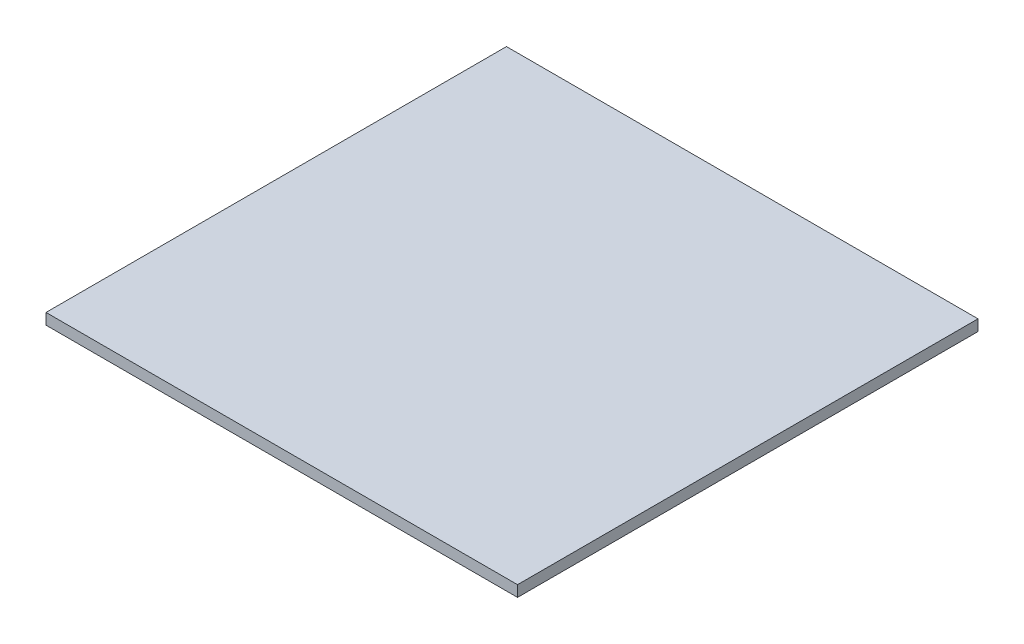
ISO-10303-21;
HEADER;
FILE_DESCRIPTION(('STEP AP214'),'2;1');
FILE_NAME('part.step','',(''),(''),'','','');
FILE_SCHEMA(('AUTOMOTIVE_DESIGN { 1 0 10303 214 1 1 1 1 }'));
ENDSEC;
DATA;
#1=APPLICATION_CONTEXT('core data for automotive mechanical design processes');
#2=APPLICATION_PROTOCOL_DEFINITION('international standard','automotive_design',2000,#1);
#3=PRODUCT_CONTEXT('',#1,'mechanical');
#4=PRODUCT('Part','Part','',(#3));
#5=PRODUCT_RELATED_PRODUCT_CATEGORY('part','',(#4));
#6=PRODUCT_DEFINITION_FORMATION('','',#4);
#7=PRODUCT_DEFINITION_CONTEXT('part definition',#1,'design');
#8=PRODUCT_DEFINITION('design','',#6,#7);
#9=PRODUCT_DEFINITION_SHAPE('','',#8);
#10=(LENGTH_UNIT() NAMED_UNIT(*) SI_UNIT(.MILLI.,.METRE.));
#11=(NAMED_UNIT(*) PLANE_ANGLE_UNIT() SI_UNIT($,.RADIAN.));
#12=(NAMED_UNIT(*) SI_UNIT($,.STERADIAN.) SOLID_ANGLE_UNIT());
#13=UNCERTAINTY_MEASURE_WITH_UNIT(LENGTH_MEASURE(1.E-05),#10,'distance_accuracy_value','');
#14=(GEOMETRIC_REPRESENTATION_CONTEXT(3) GLOBAL_UNCERTAINTY_ASSIGNED_CONTEXT((#13)) GLOBAL_UNIT_ASSIGNED_CONTEXT((#10,
#11,#12)) REPRESENTATION_CONTEXT('',''));
#15=CARTESIAN_POINT('',(0.,0.,0.));
#16=DIRECTION('',(0.,0.,1.));
#17=DIRECTION('',(1.,0.,0.));
#18=AXIS2_PLACEMENT_3D('',#15,#16,#17);
#19=CARTESIAN_POINT('',(-101.6,4.7625,-99.21875));
#20=DIRECTION('',(1.,0.,0.));
#21=DIRECTION('',(0.,0.,-1.));
#22=AXIS2_PLACEMENT_3D('',#19,#20,#21);
#23=PLANE('',#22);
#24=DIRECTION('',(0.,0.,1.));
#25=VECTOR('',#24,1.);
#26=CARTESIAN_POINT('',(-101.6,0.,-99.21875));
#27=LINE('',#26,#25);
#28=CARTESIAN_POINT('',(-101.6,0.,-99.21875));
#29=VERTEX_POINT('',#28);
#30=CARTESIAN_POINT('',(-101.6,0.,99.21875));
#31=VERTEX_POINT('',#30);
#32=EDGE_CURVE('E106',#29,#31,#27,.T.);
#33=ORIENTED_EDGE('',*,*,#32,.T.);
#34=DIRECTION('',(0.,-1.,0.));
#35=VECTOR('',#34,1.);
#36=CARTESIAN_POINT('',(-101.6,4.7625,99.21875));
#37=LINE('',#36,#35);
#38=CARTESIAN_POINT('',(-101.6,4.7625,99.21875));
#39=VERTEX_POINT('',#38);
#40=EDGE_CURVE('E11',#39,#31,#37,.T.);
#41=ORIENTED_EDGE('',*,*,#40,.F.);
#42=DIRECTION('',(0.,0.,1.));
#43=VECTOR('',#42,1.);
#44=CARTESIAN_POINT('',(-101.6,4.7625,-99.21875));
#45=LINE('',#44,#43);
#46=CARTESIAN_POINT('',(-101.6,4.7625,-99.21875));
#47=VERTEX_POINT('',#46);
#48=EDGE_CURVE('E89',#47,#39,#45,.T.);
#49=ORIENTED_EDGE('',*,*,#48,.F.);
#50=DIRECTION('',(0.,-1.,0.));
#51=VECTOR('',#50,1.);
#52=CARTESIAN_POINT('',(-101.6,4.7625,-99.21875));
#53=LINE('',#52,#51);
#54=EDGE_CURVE('E102',#47,#29,#53,.T.);
#55=ORIENTED_EDGE('',*,*,#54,.T.);
#56=EDGE_LOOP('',(#33,#41,#49,#55));
#57=FACE_BOUND('',#56,.T.);
#58=ADVANCED_FACE('F37',(#57),#23,.F.);
#59=CARTESIAN_POINT('',(101.6,4.7625,99.21875));
#60=DIRECTION('',(0.,0.,-1.));
#61=DIRECTION('',(-1.,0.,0.));
#62=AXIS2_PLACEMENT_3D('',#59,#60,#61);
#63=PLANE('',#62);
#64=DIRECTION('',(1.,0.,0.));
#65=VECTOR('',#64,1.);
#66=CARTESIAN_POINT('',(101.6,0.,99.21875));
#67=LINE('',#66,#65);
#68=CARTESIAN_POINT('',(101.6,0.,99.21875));
#69=VERTEX_POINT('',#68);
#70=EDGE_CURVE('E94',#31,#69,#67,.T.);
#71=ORIENTED_EDGE('',*,*,#70,.T.);
#72=DIRECTION('',(0.,-1.,0.));
#73=VECTOR('',#72,1.);
#74=CARTESIAN_POINT('',(101.6,4.7625,99.21875));
#75=LINE('',#74,#73);
#76=CARTESIAN_POINT('',(101.6,4.7625,99.21875));
#77=VERTEX_POINT('',#76);
#78=EDGE_CURVE('E45',#77,#69,#75,.T.);
#79=ORIENTED_EDGE('',*,*,#78,.F.);
#80=DIRECTION('',(1.,0.,0.));
#81=VECTOR('',#80,1.);
#82=CARTESIAN_POINT('',(101.6,4.7625,99.21875));
#83=LINE('',#82,#81);
#84=EDGE_CURVE('E84',#39,#77,#83,.T.);
#85=ORIENTED_EDGE('',*,*,#84,.F.);
#86=ORIENTED_EDGE('',*,*,#40,.T.);
#87=EDGE_LOOP('',(#71,#79,#85,#86));
#88=FACE_BOUND('',#87,.T.);
#89=ADVANCED_FACE('F93',(#88),#63,.F.);
#90=CARTESIAN_POINT('',(101.6,4.7625,-99.21875));
#91=DIRECTION('',(-1.,0.,0.));
#92=DIRECTION('',(0.,0.,1.));
#93=AXIS2_PLACEMENT_3D('',#90,#91,#92);
#94=PLANE('',#93);
#95=DIRECTION('',(0.,0.,-1.));
#96=VECTOR('',#95,1.);
#97=CARTESIAN_POINT('',(101.6,0.,-99.21875));
#98=LINE('',#97,#96);
#99=CARTESIAN_POINT('',(101.6,0.,-99.21875));
#100=VERTEX_POINT('',#99);
#101=EDGE_CURVE('E70',#69,#100,#98,.T.);
#102=ORIENTED_EDGE('',*,*,#101,.T.);
#103=DIRECTION('',(0.,-1.,0.));
#104=VECTOR('',#103,1.);
#105=CARTESIAN_POINT('',(101.6,4.7625,-99.21875));
#106=LINE('',#105,#104);
#107=CARTESIAN_POINT('',(101.6,4.7625,-99.21875));
#108=VERTEX_POINT('',#107);
#109=EDGE_CURVE('E95',#108,#100,#106,.T.);
#110=ORIENTED_EDGE('',*,*,#109,.F.);
#111=DIRECTION('',(0.,0.,-1.));
#112=VECTOR('',#111,1.);
#113=CARTESIAN_POINT('',(101.6,4.7625,-99.21875));
#114=LINE('',#113,#112);
#115=EDGE_CURVE('E87',#77,#108,#114,.T.);
#116=ORIENTED_EDGE('',*,*,#115,.F.);
#117=ORIENTED_EDGE('',*,*,#78,.T.);
#118=EDGE_LOOP('',(#102,#110,#116,#117));
#119=FACE_BOUND('',#118,.T.);
#120=ADVANCED_FACE('F96',(#119),#94,.F.);
#121=CARTESIAN_POINT('',(101.6,4.7625,-99.21875));
#122=DIRECTION('',(0.,0.,1.));
#123=DIRECTION('',(1.,0.,0.));
#124=AXIS2_PLACEMENT_3D('',#121,#122,#123);
#125=PLANE('',#124);
#126=DIRECTION('',(-1.,0.,0.));
#127=VECTOR('',#126,1.);
#128=CARTESIAN_POINT('',(101.6,0.,-99.21875));
#129=LINE('',#128,#127);
#130=EDGE_CURVE('E77',#100,#29,#129,.T.);
#131=ORIENTED_EDGE('',*,*,#130,.T.);
#132=ORIENTED_EDGE('',*,*,#54,.F.);
#133=DIRECTION('',(-1.,0.,0.));
#134=VECTOR('',#133,1.);
#135=CARTESIAN_POINT('',(101.6,4.7625,-99.21875));
#136=LINE('',#135,#134);
#137=EDGE_CURVE('E53',#108,#47,#136,.T.);
#138=ORIENTED_EDGE('',*,*,#137,.F.);
#139=ORIENTED_EDGE('',*,*,#109,.T.);
#140=EDGE_LOOP('',(#131,#132,#138,#139));
#141=FACE_BOUND('',#140,.T.);
#142=ADVANCED_FACE('F116',(#141),#125,.F.);
#143=CARTESIAN_POINT('',(-101.6,4.7625,99.21875));
#144=DIRECTION('',(0.,-1.,0.));
#145=DIRECTION('',(0.,0.,-1.));
#146=AXIS2_PLACEMENT_3D('',#143,#144,#145);
#147=PLANE('',#146);
#148=ORIENTED_EDGE('',*,*,#48,.T.);
#149=ORIENTED_EDGE('',*,*,#84,.T.);
#150=ORIENTED_EDGE('',*,*,#115,.T.);
#151=ORIENTED_EDGE('',*,*,#137,.T.);
#152=EDGE_LOOP('',(#148,#149,#150,#151));
#153=FACE_BOUND('',#152,.T.);
#154=ADVANCED_FACE('F85',(#153),#147,.F.);
#155=CARTESIAN_POINT('',(-101.6,0.,99.21875));
#156=DIRECTION('',(0.,-1.,0.));
#157=DIRECTION('',(0.,0.,-1.));
#158=AXIS2_PLACEMENT_3D('',#155,#156,#157);
#159=PLANE('',#158);
#160=ORIENTED_EDGE('',*,*,#32,.F.);
#161=ORIENTED_EDGE('',*,*,#130,.F.);
#162=ORIENTED_EDGE('',*,*,#101,.F.);
#163=ORIENTED_EDGE('',*,*,#70,.F.);
#164=EDGE_LOOP('',(#160,#161,#162,#163));
#165=FACE_BOUND('',#164,.T.);
#166=ADVANCED_FACE('F119',(#165),#159,.T.);
#167=CLOSED_SHELL('',(#58,#89,#120,#142,#154,#166));
#168=MANIFOLD_SOLID_BREP('B2',#167);
#169=ADVANCED_BREP_SHAPE_REPRESENTATION('',(#18,#168),#14);
#170=SHAPE_DEFINITION_REPRESENTATION(#9,#169);
ENDSEC;
END-ISO-10303-21;
